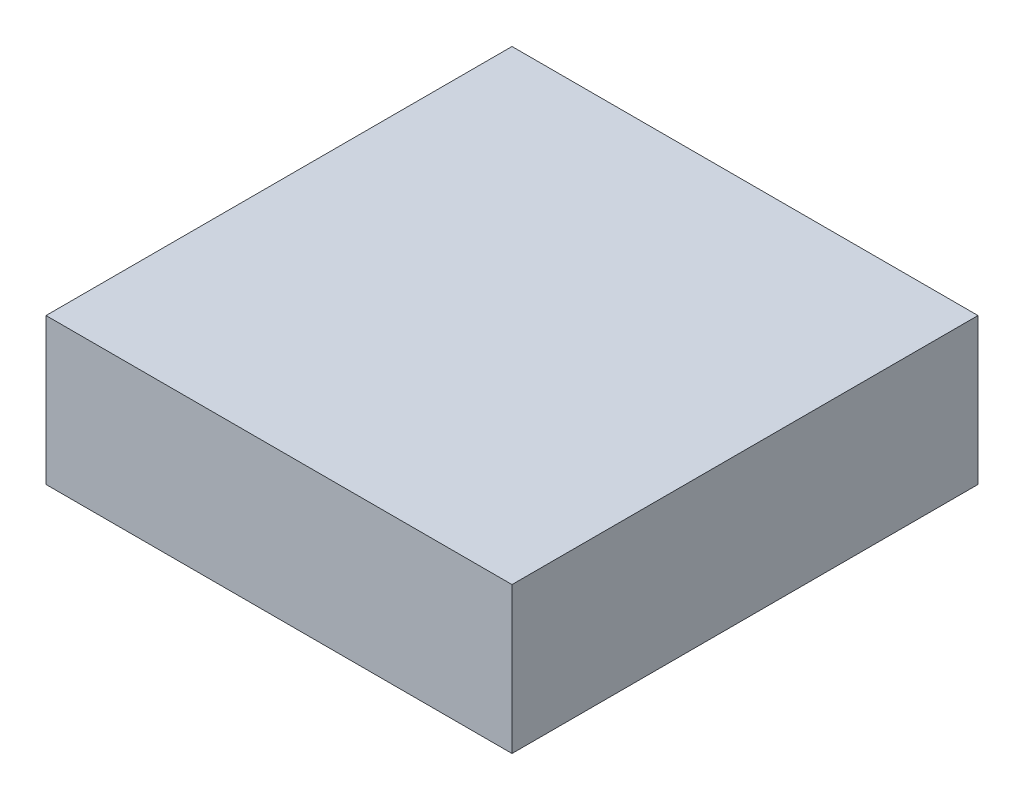
ISO-10303-21;
HEADER;
FILE_DESCRIPTION(('STEP AP214'),'2;1');
FILE_NAME('part.step','',(''),(''),'','','');
FILE_SCHEMA(('AUTOMOTIVE_DESIGN { 1 0 10303 214 1 1 1 1 }'));
ENDSEC;
DATA;
#1=APPLICATION_CONTEXT('core data for automotive mechanical design processes');
#2=APPLICATION_PROTOCOL_DEFINITION('international standard','automotive_design',2000,#1);
#3=PRODUCT_CONTEXT('',#1,'mechanical');
#4=PRODUCT('Part','Part','',(#3));
#5=PRODUCT_RELATED_PRODUCT_CATEGORY('part','',(#4));
#6=PRODUCT_DEFINITION_FORMATION('','',#4);
#7=PRODUCT_DEFINITION_CONTEXT('part definition',#1,'design');
#8=PRODUCT_DEFINITION('design','',#6,#7);
#9=PRODUCT_DEFINITION_SHAPE('','',#8);
#10=(LENGTH_UNIT() NAMED_UNIT(*) SI_UNIT(.MILLI.,.METRE.));
#11=(NAMED_UNIT(*) PLANE_ANGLE_UNIT() SI_UNIT($,.RADIAN.));
#12=(NAMED_UNIT(*) SI_UNIT($,.STERADIAN.) SOLID_ANGLE_UNIT());
#13=UNCERTAINTY_MEASURE_WITH_UNIT(LENGTH_MEASURE(1.E-05),#10,'distance_accuracy_value','');
#14=(GEOMETRIC_REPRESENTATION_CONTEXT(3) GLOBAL_UNCERTAINTY_ASSIGNED_CONTEXT((#13)) GLOBAL_UNIT_ASSIGNED_CONTEXT((#10,
#11,#12)) REPRESENTATION_CONTEXT('',''));
#15=CARTESIAN_POINT('',(0.,0.,0.));
#16=DIRECTION('',(0.,0.,1.));
#17=DIRECTION('',(1.,0.,0.));
#18=AXIS2_PLACEMENT_3D('',#15,#16,#17);
#19=CARTESIAN_POINT('',(0.,1.57,0.));
#20=DIRECTION('',(1.,0.,0.));
#21=DIRECTION('',(0.,0.,-1.));
#22=AXIS2_PLACEMENT_3D('',#19,#20,#21);
#23=PLANE('',#22);
#24=DIRECTION('',(0.,0.,1.));
#25=VECTOR('',#24,1.);
#26=CARTESIAN_POINT('',(0.,0.,0.));
#27=LINE('',#26,#25);
#28=CARTESIAN_POINT('',(0.,0.,-5.));
#29=VERTEX_POINT('',#28);
#30=CARTESIAN_POINT('',(0.,0.,0.));
#31=VERTEX_POINT('',#30);
#32=EDGE_CURVE('E111',#29,#31,#27,.T.);
#33=ORIENTED_EDGE('',*,*,#32,.T.);
#34=DIRECTION('',(0.,-1.,0.));
#35=VECTOR('',#34,1.);
#36=CARTESIAN_POINT('',(0.,1.57,0.));
#37=LINE('',#36,#35);
#38=CARTESIAN_POINT('',(0.,1.57,0.));
#39=VERTEX_POINT('',#38);
#40=EDGE_CURVE('E11',#39,#31,#37,.T.);
#41=ORIENTED_EDGE('',*,*,#40,.F.);
#42=DIRECTION('',(0.,0.,1.));
#43=VECTOR('',#42,1.);
#44=CARTESIAN_POINT('',(0.,1.57,0.));
#45=LINE('',#44,#43);
#46=CARTESIAN_POINT('',(0.,1.57,-5.));
#47=VERTEX_POINT('',#46);
#48=EDGE_CURVE('E95',#47,#39,#45,.T.);
#49=ORIENTED_EDGE('',*,*,#48,.F.);
#50=DIRECTION('',(0.,-1.,0.));
#51=VECTOR('',#50,1.);
#52=CARTESIAN_POINT('',(0.,1.57,-5.));
#53=LINE('',#52,#51);
#54=EDGE_CURVE('E107',#47,#29,#53,.T.);
#55=ORIENTED_EDGE('',*,*,#54,.T.);
#56=EDGE_LOOP('',(#33,#41,#49,#55));
#57=FACE_BOUND('',#56,.T.);
#58=ADVANCED_FACE('F43',(#57),#23,.F.);
#59=CARTESIAN_POINT('',(0.,1.57,0.));
#60=DIRECTION('',(0.,0.,-1.));
#61=DIRECTION('',(-1.,0.,0.));
#62=AXIS2_PLACEMENT_3D('',#59,#60,#61);
#63=PLANE('',#62);
#64=DIRECTION('',(1.,0.,0.));
#65=VECTOR('',#64,1.);
#66=CARTESIAN_POINT('',(0.,0.,0.));
#67=LINE('',#66,#65);
#68=CARTESIAN_POINT('',(5.,0.,0.));
#69=VERTEX_POINT('',#68);
#70=EDGE_CURVE('E100',#31,#69,#67,.T.);
#71=ORIENTED_EDGE('',*,*,#70,.T.);
#72=DIRECTION('',(0.,-1.,0.));
#73=VECTOR('',#72,1.);
#74=CARTESIAN_POINT('',(5.,1.57,0.));
#75=LINE('',#74,#73);
#76=CARTESIAN_POINT('',(5.,1.57,0.));
#77=VERTEX_POINT('',#76);
#78=EDGE_CURVE('E52',#77,#69,#75,.T.);
#79=ORIENTED_EDGE('',*,*,#78,.F.);
#80=DIRECTION('',(1.,0.,0.));
#81=VECTOR('',#80,1.);
#82=CARTESIAN_POINT('',(0.,1.57,0.));
#83=LINE('',#82,#81);
#84=EDGE_CURVE('E90',#39,#77,#83,.T.);
#85=ORIENTED_EDGE('',*,*,#84,.F.);
#86=ORIENTED_EDGE('',*,*,#40,.T.);
#87=EDGE_LOOP('',(#71,#79,#85,#86));
#88=FACE_BOUND('',#87,.T.);
#89=ADVANCED_FACE('F99',(#88),#63,.F.);
#90=CARTESIAN_POINT('',(5.,1.57,0.));
#91=DIRECTION('',(-1.,0.,0.));
#92=DIRECTION('',(0.,0.,1.));
#93=AXIS2_PLACEMENT_3D('',#90,#91,#92);
#94=PLANE('',#93);
#95=DIRECTION('',(0.,0.,-1.));
#96=VECTOR('',#95,1.);
#97=CARTESIAN_POINT('',(5.,0.,0.));
#98=LINE('',#97,#96);
#99=CARTESIAN_POINT('',(5.,0.,-5.));
#100=VERTEX_POINT('',#99);
#101=EDGE_CURVE('E77',#69,#100,#98,.T.);
#102=ORIENTED_EDGE('',*,*,#101,.T.);
#103=DIRECTION('',(0.,-1.,0.));
#104=VECTOR('',#103,1.);
#105=CARTESIAN_POINT('',(5.,1.57,-5.));
#106=LINE('',#105,#104);
#107=CARTESIAN_POINT('',(5.,1.57,-5.));
#108=VERTEX_POINT('',#107);
#109=EDGE_CURVE('E102',#108,#100,#106,.T.);
#110=ORIENTED_EDGE('',*,*,#109,.F.);
#111=DIRECTION('',(0.,0.,-1.));
#112=VECTOR('',#111,1.);
#113=CARTESIAN_POINT('',(5.,1.57,0.));
#114=LINE('',#113,#112);
#115=EDGE_CURVE('E93',#77,#108,#114,.T.);
#116=ORIENTED_EDGE('',*,*,#115,.F.);
#117=ORIENTED_EDGE('',*,*,#78,.T.);
#118=EDGE_LOOP('',(#102,#110,#116,#117));
#119=FACE_BOUND('',#118,.T.);
#120=ADVANCED_FACE('F103',(#119),#94,.F.);
#121=CARTESIAN_POINT('',(0.,1.57,-5.));
#122=DIRECTION('',(0.,0.,1.));
#123=DIRECTION('',(1.,0.,0.));
#124=AXIS2_PLACEMENT_3D('',#121,#122,#123);
#125=PLANE('',#124);
#126=DIRECTION('',(-1.,0.,0.));
#127=VECTOR('',#126,1.);
#128=CARTESIAN_POINT('',(0.,0.,-5.));
#129=LINE('',#128,#127);
#130=EDGE_CURVE('E83',#100,#29,#129,.T.);
#131=ORIENTED_EDGE('',*,*,#130,.T.);
#132=ORIENTED_EDGE('',*,*,#54,.F.);
#133=DIRECTION('',(-1.,0.,0.));
#134=VECTOR('',#133,1.);
#135=CARTESIAN_POINT('',(0.,1.57,-5.));
#136=LINE('',#135,#134);
#137=EDGE_CURVE('E60',#108,#47,#136,.T.);
#138=ORIENTED_EDGE('',*,*,#137,.F.);
#139=ORIENTED_EDGE('',*,*,#109,.T.);
#140=EDGE_LOOP('',(#131,#132,#138,#139));
#141=FACE_BOUND('',#140,.T.);
#142=ADVANCED_FACE('F124',(#141),#125,.F.);
#143=CARTESIAN_POINT('',(0.,1.57,0.));
#144=DIRECTION('',(0.,-1.,0.));
#145=DIRECTION('',(0.,0.,-1.));
#146=AXIS2_PLACEMENT_3D('',#143,#144,#145);
#147=PLANE('',#146);
#148=ORIENTED_EDGE('',*,*,#48,.T.);
#149=ORIENTED_EDGE('',*,*,#84,.T.);
#150=ORIENTED_EDGE('',*,*,#115,.T.);
#151=ORIENTED_EDGE('',*,*,#137,.T.);
#152=EDGE_LOOP('',(#148,#149,#150,#151));
#153=FACE_BOUND('',#152,.T.);
#154=ADVANCED_FACE('F91',(#153),#147,.F.);
#155=CARTESIAN_POINT('',(0.,0.,0.));
#156=DIRECTION('',(0.,-1.,0.));
#157=DIRECTION('',(0.,0.,-1.));
#158=AXIS2_PLACEMENT_3D('',#155,#156,#157);
#159=PLANE('',#158);
#160=ORIENTED_EDGE('',*,*,#32,.F.);
#161=ORIENTED_EDGE('',*,*,#130,.F.);
#162=ORIENTED_EDGE('',*,*,#101,.F.);
#163=ORIENTED_EDGE('',*,*,#70,.F.);
#164=EDGE_LOOP('',(#160,#161,#162,#163));
#165=FACE_BOUND('',#164,.T.);
#166=ADVANCED_FACE('F127',(#165),#159,.T.);
#167=CLOSED_SHELL('',(#58,#89,#120,#142,#154,#166));
#168=MANIFOLD_SOLID_BREP('B2',#167);
#169=ADVANCED_BREP_SHAPE_REPRESENTATION('',(#18,#168),#14);
#170=SHAPE_DEFINITION_REPRESENTATION(#9,#169);
ENDSEC;
END-ISO-10303-21;
